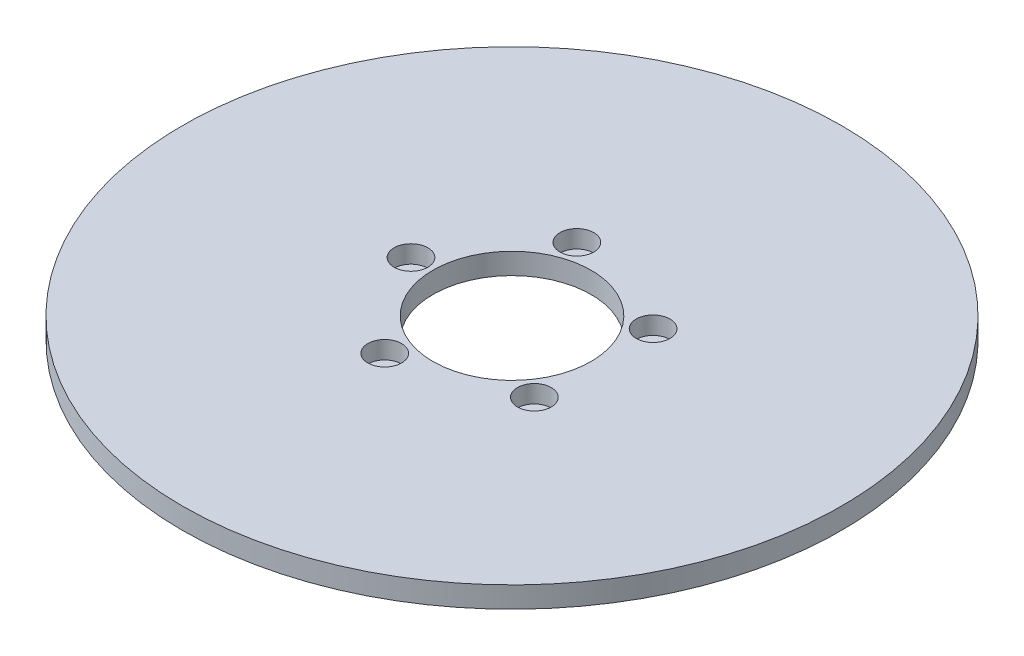
ISO-10303-21;
HEADER;
FILE_DESCRIPTION(('STEP AP214'),'2;1');
FILE_NAME('part.step','',(''),(''),'','','');
FILE_SCHEMA(('AUTOMOTIVE_DESIGN { 1 0 10303 214 1 1 1 1 }'));
ENDSEC;
DATA;
#1=APPLICATION_CONTEXT('core data for automotive mechanical design processes');
#2=APPLICATION_PROTOCOL_DEFINITION('international standard','automotive_design',2000,#1);
#3=PRODUCT_CONTEXT('',#1,'mechanical');
#4=PRODUCT('Part','Part','',(#3));
#5=PRODUCT_RELATED_PRODUCT_CATEGORY('part','',(#4));
#6=PRODUCT_DEFINITION_FORMATION('','',#4);
#7=PRODUCT_DEFINITION_CONTEXT('part definition',#1,'design');
#8=PRODUCT_DEFINITION('design','',#6,#7);
#9=PRODUCT_DEFINITION_SHAPE('','',#8);
#10=(LENGTH_UNIT() NAMED_UNIT(*) SI_UNIT(.MILLI.,.METRE.));
#11=(NAMED_UNIT(*) PLANE_ANGLE_UNIT() SI_UNIT($,.RADIAN.));
#12=(NAMED_UNIT(*) SI_UNIT($,.STERADIAN.) SOLID_ANGLE_UNIT());
#13=UNCERTAINTY_MEASURE_WITH_UNIT(LENGTH_MEASURE(1.E-05),#10,'distance_accuracy_value','');
#14=(GEOMETRIC_REPRESENTATION_CONTEXT(3) GLOBAL_UNCERTAINTY_ASSIGNED_CONTEXT((#13)) GLOBAL_UNIT_ASSIGNED_CONTEXT((#10,
#11,#12)) REPRESENTATION_CONTEXT('',''));
#15=CARTESIAN_POINT('',(0.,0.,0.));
#16=DIRECTION('',(0.,0.,1.));
#17=DIRECTION('',(1.,0.,0.));
#18=AXIS2_PLACEMENT_3D('',#15,#16,#17);
#19=CARTESIAN_POINT('',(0.,4.,0.));
#20=DIRECTION('',(0.,-1.,0.));
#21=DIRECTION('',(0.,0.,-1.));
#22=AXIS2_PLACEMENT_3D('',#19,#20,#21);
#23=CYLINDRICAL_SURFACE('',#22,62.5);
#24=CARTESIAN_POINT('',(0.,4.,0.));
#25=DIRECTION('',(0.,1.,0.));
#26=DIRECTION('',(0.,0.,1.));
#27=AXIS2_PLACEMENT_3D('',#24,#25,#26);
#28=CIRCLE('',#27,62.5);
#29=CARTESIAN_POINT('',(0.,4.,62.5));
#30=VERTEX_POINT('',#29);
#31=EDGE_CURVE('E10',#30,#30,#28,.T.);
#32=ORIENTED_EDGE('',*,*,#31,.F.);
#33=EDGE_LOOP('',(#32));
#34=FACE_BOUND('',#33,.T.);
#35=CARTESIAN_POINT('',(0.,0.,0.));
#36=DIRECTION('',(0.,1.,0.));
#37=DIRECTION('',(0.,0.,1.));
#38=AXIS2_PLACEMENT_3D('',#35,#36,#37);
#39=CIRCLE('',#38,62.5);
#40=CARTESIAN_POINT('',(0.,0.,62.5));
#41=VERTEX_POINT('',#40);
#42=EDGE_CURVE('E37',#41,#41,#39,.T.);
#43=ORIENTED_EDGE('',*,*,#42,.T.);
#44=EDGE_LOOP('',(#43));
#45=FACE_BOUND('',#44,.T.);
#46=ADVANCED_FACE('F40',(#34,#45),#23,.T.);
#47=CARTESIAN_POINT('',(0.,4.,0.));
#48=DIRECTION('',(0.,1.,0.));
#49=DIRECTION('',(0.,0.,1.));
#50=AXIS2_PLACEMENT_3D('',#47,#48,#49);
#51=PLANE('',#50);
#52=CARTESIAN_POINT('',(-5.91968348037825,4.,18.2189123928486));
#53=DIRECTION('',(0.,1.,0.));
#54=DIRECTION('',(0.951056516295155,0.,0.309016994374945));
#55=AXIS2_PLACEMENT_3D('',#52,#53,#54);
#56=CIRCLE('',#55,3.20142961197286);
#57=CARTESIAN_POINT('',(-2.87494298645119,4.,19.2082085492434));
#58=VERTEX_POINT('',#57);
#59=EDGE_CURVE('E78',#58,#58,#56,.T.);
#60=ORIENTED_EDGE('',*,*,#59,.F.);
#61=EDGE_LOOP('',(#60));
#62=FACE_BOUND('',#61,.T.);
#63=CARTESIAN_POINT('',(15.4979325542717,4.,11.259907096837));
#64=DIRECTION('',(0.,1.,0.));
#65=DIRECTION('',(0.587785252292469,0.,-0.809016994374951));
#66=AXIS2_PLACEMENT_3D('',#63,#64,#65);
#67=CIRCLE('',#66,3.20142961197286);
#68=CARTESIAN_POINT('',(17.3796856664418,4.,8.66989613445578));
#69=VERTEX_POINT('',#68);
#70=EDGE_CURVE('E71',#69,#69,#67,.T.);
#71=ORIENTED_EDGE('',*,*,#70,.F.);
#72=EDGE_LOOP('',(#71));
#73=FACE_BOUND('',#72,.T.);
#74=CARTESIAN_POINT('',(15.4979325542716,4.,-11.2599070968373));
#75=DIRECTION('',(0.,1.,0.));
#76=DIRECTION('',(-0.58778525229248,0.,-0.809016994374942));
#77=AXIS2_PLACEMENT_3D('',#74,#75,#76);
#78=CIRCLE('',#77,3.20142961197286);
#79=CARTESIAN_POINT('',(13.6161794421015,4.,-13.8499180592185));
#80=VERTEX_POINT('',#79);
#81=EDGE_CURVE('E70',#80,#80,#78,.T.);
#82=ORIENTED_EDGE('',*,*,#81,.F.);
#83=EDGE_LOOP('',(#82));
#84=FACE_BOUND('',#83,.T.);
#85=CARTESIAN_POINT('',(-5.91968348037851,4.,-18.2189123928485));
#86=DIRECTION('',(0.,1.,0.));
#87=DIRECTION('',(-0.95105651629515,0.,0.309016994374958));
#88=AXIS2_PLACEMENT_3D('',#85,#86,#87);
#89=CIRCLE('',#88,3.20142961197286);
#90=CARTESIAN_POINT('',(-8.96442397430555,4.,-17.2296162364537));
#91=VERTEX_POINT('',#90);
#92=EDGE_CURVE('E61',#91,#91,#89,.T.);
#93=ORIENTED_EDGE('',*,*,#92,.F.);
#94=EDGE_LOOP('',(#93));
#95=FACE_BOUND('',#94,.T.);
#96=CARTESIAN_POINT('',(-19.1564981477867,4.,0.));
#97=DIRECTION('',(0.,1.,0.));
#98=DIRECTION('',(0.,0.,1.));
#99=AXIS2_PLACEMENT_3D('',#96,#97,#98);
#100=CIRCLE('',#99,3.20142961197286);
#101=CARTESIAN_POINT('',(-19.1564981477867,4.,3.20142961197286));
#102=VERTEX_POINT('',#101);
#103=EDGE_CURVE('E54',#102,#102,#100,.T.);
#104=ORIENTED_EDGE('',*,*,#103,.F.);
#105=EDGE_LOOP('',(#104));
#106=FACE_BOUND('',#105,.T.);
#107=CARTESIAN_POINT('',(0.,4.,0.));
#108=DIRECTION('',(0.,1.,0.));
#109=DIRECTION('',(0.,0.,1.));
#110=AXIS2_PLACEMENT_3D('',#107,#108,#109);
#111=CIRCLE('',#110,15.);
#112=CARTESIAN_POINT('',(0.,4.,15.));
#113=VERTEX_POINT('',#112);
#114=EDGE_CURVE('E50',#113,#113,#111,.T.);
#115=ORIENTED_EDGE('',*,*,#114,.F.);
#116=EDGE_LOOP('',(#115));
#117=FACE_BOUND('',#116,.T.);
#118=ORIENTED_EDGE('',*,*,#31,.T.);
#119=EDGE_LOOP('',(#118));
#120=FACE_BOUND('',#119,.T.);
#121=ADVANCED_FACE('F94',(#62,#73,#84,#95,#106,#117,#120),#51,.T.);
#122=CARTESIAN_POINT('',(0.,0.,0.));
#123=DIRECTION('',(0.,1.,0.));
#124=DIRECTION('',(0.,0.,1.));
#125=AXIS2_PLACEMENT_3D('',#122,#123,#124);
#126=PLANE('',#125);
#127=CARTESIAN_POINT('',(0.,0.,0.));
#128=DIRECTION('',(0.,1.,0.));
#129=DIRECTION('',(0.,0.,1.));
#130=AXIS2_PLACEMENT_3D('',#127,#128,#129);
#131=CIRCLE('',#130,15.);
#132=CARTESIAN_POINT('',(0.,0.,15.));
#133=VERTEX_POINT('',#132);
#134=EDGE_CURVE('E47',#133,#133,#131,.T.);
#135=ORIENTED_EDGE('',*,*,#134,.T.);
#136=EDGE_LOOP('',(#135));
#137=FACE_BOUND('',#136,.T.);
#138=ORIENTED_EDGE('',*,*,#42,.F.);
#139=EDGE_LOOP('',(#138));
#140=FACE_BOUND('',#139,.T.);
#141=ADVANCED_FACE('F100',(#137,#140),#126,.F.);
#142=CARTESIAN_POINT('',(0.,4.,0.));
#143=DIRECTION('',(0.,-1.,0.));
#144=DIRECTION('',(0.,0.,-1.));
#145=AXIS2_PLACEMENT_3D('',#142,#143,#144);
#146=CYLINDRICAL_SURFACE('',#145,15.);
#147=ORIENTED_EDGE('',*,*,#114,.T.);
#148=EDGE_LOOP('',(#147));
#149=FACE_BOUND('',#148,.T.);
#150=ORIENTED_EDGE('',*,*,#134,.F.);
#151=EDGE_LOOP('',(#150));
#152=FACE_BOUND('',#151,.T.);
#153=ADVANCED_FACE('F108',(#149,#152),#146,.F.);
#154=CARTESIAN_POINT('',(-19.1564981477867,0.639174739748794,0.));
#155=DIRECTION('',(0.,1.,0.));
#156=DIRECTION('',(0.,0.,1.));
#157=AXIS2_PLACEMENT_3D('',#154,#155,#156);
#158=CYLINDRICAL_SURFACE('',#157,3.20142961197286);
#159=CARTESIAN_POINT('',(-19.1564981477867,0.639174739748794,0.));
#160=DIRECTION('',(0.,1.,0.));
#161=DIRECTION('',(0.,0.,1.));
#162=AXIS2_PLACEMENT_3D('',#159,#160,#161);
#163=CIRCLE('',#162,3.20142961197286);
#164=CARTESIAN_POINT('',(-19.1564981477867,0.639174739748794,3.20142961197286));
#165=VERTEX_POINT('',#164);
#166=EDGE_CURVE('E55',#165,#165,#163,.T.);
#167=ORIENTED_EDGE('',*,*,#166,.F.);
#168=EDGE_LOOP('',(#167));
#169=FACE_BOUND('',#168,.T.);
#170=ORIENTED_EDGE('',*,*,#103,.T.);
#171=EDGE_LOOP('',(#170));
#172=FACE_BOUND('',#171,.T.);
#173=ADVANCED_FACE('F115',(#169,#172),#158,.F.);
#174=CARTESIAN_POINT('',(-19.1564981477867,0.639174739748794,0.));
#175=DIRECTION('',(0.,1.,0.));
#176=DIRECTION('',(0.,0.,1.));
#177=AXIS2_PLACEMENT_3D('',#174,#175,#176);
#178=PLANE('',#177);
#179=ORIENTED_EDGE('',*,*,#166,.T.);
#180=EDGE_LOOP('',(#179));
#181=FACE_BOUND('',#180,.T.);
#182=ADVANCED_FACE('F142',(#181),#178,.T.);
#183=CARTESIAN_POINT('',(-5.91968348037851,0.639174739748794,-18.2189123928485));
#184=DIRECTION('',(0.,1.,0.));
#185=DIRECTION('',(0.,0.,1.));
#186=AXIS2_PLACEMENT_3D('',#183,#184,#185);
#187=CYLINDRICAL_SURFACE('',#186,3.20142961197286);
#188=CARTESIAN_POINT('',(-5.91968348037851,0.639174739748794,-18.2189123928485));
#189=DIRECTION('',(0.,1.,0.));
#190=DIRECTION('',(-0.95105651629515,0.,0.309016994374958));
#191=AXIS2_PLACEMENT_3D('',#188,#189,#190);
#192=CIRCLE('',#191,3.20142961197286);
#193=CARTESIAN_POINT('',(-8.96442397430555,0.639174739748794,-17.2296162364537));
#194=VERTEX_POINT('',#193);
#195=EDGE_CURVE('E63',#194,#194,#192,.T.);
#196=ORIENTED_EDGE('',*,*,#195,.F.);
#197=EDGE_LOOP('',(#196));
#198=FACE_BOUND('',#197,.T.);
#199=ORIENTED_EDGE('',*,*,#92,.T.);
#200=EDGE_LOOP('',(#199));
#201=FACE_BOUND('',#200,.T.);
#202=ADVANCED_FACE('F147',(#198,#201),#187,.F.);
#203=CARTESIAN_POINT('',(-5.91968348037851,0.639174739748794,-18.2189123928485));
#204=DIRECTION('',(0.,1.,0.));
#205=DIRECTION('',(-0.95105651629515,0.,0.309016994374958));
#206=AXIS2_PLACEMENT_3D('',#203,#204,#205);
#207=PLANE('',#206);
#208=ORIENTED_EDGE('',*,*,#195,.T.);
#209=EDGE_LOOP('',(#208));
#210=FACE_BOUND('',#209,.T.);
#211=ADVANCED_FACE('F163',(#210),#207,.T.);
#212=CARTESIAN_POINT('',(15.4979325542716,0.639174739748794,-11.2599070968373));
#213=DIRECTION('',(0.,1.,0.));
#214=DIRECTION('',(0.,0.,1.));
#215=AXIS2_PLACEMENT_3D('',#212,#213,#214);
#216=CYLINDRICAL_SURFACE('',#215,3.20142961197286);
#217=CARTESIAN_POINT('',(15.4979325542716,0.639174739748794,-11.2599070968373));
#218=DIRECTION('',(0.,1.,0.));
#219=DIRECTION('',(-0.58778525229248,0.,-0.809016994374942));
#220=AXIS2_PLACEMENT_3D('',#217,#218,#219);
#221=CIRCLE('',#220,3.20142961197286);
#222=CARTESIAN_POINT('',(13.6161794421015,0.639174739748794,-13.8499180592185));
#223=VERTEX_POINT('',#222);
#224=EDGE_CURVE('E69',#223,#223,#221,.T.);
#225=ORIENTED_EDGE('',*,*,#224,.F.);
#226=EDGE_LOOP('',(#225));
#227=FACE_BOUND('',#226,.T.);
#228=ORIENTED_EDGE('',*,*,#81,.T.);
#229=EDGE_LOOP('',(#228));
#230=FACE_BOUND('',#229,.T.);
#231=ADVANCED_FACE('F172',(#227,#230),#216,.F.);
#232=CARTESIAN_POINT('',(15.4979325542716,0.639174739748794,-11.2599070968373));
#233=DIRECTION('',(0.,1.,0.));
#234=DIRECTION('',(-0.58778525229248,0.,-0.809016994374942));
#235=AXIS2_PLACEMENT_3D('',#232,#233,#234);
#236=PLANE('',#235);
#237=ORIENTED_EDGE('',*,*,#224,.T.);
#238=EDGE_LOOP('',(#237));
#239=FACE_BOUND('',#238,.T.);
#240=ADVANCED_FACE('F185',(#239),#236,.T.);
#241=CARTESIAN_POINT('',(15.4979325542717,0.639174739748794,11.259907096837));
#242=DIRECTION('',(0.,1.,0.));
#243=DIRECTION('',(0.,0.,1.));
#244=AXIS2_PLACEMENT_3D('',#241,#242,#243);
#245=CYLINDRICAL_SURFACE('',#244,3.20142961197286);
#246=CARTESIAN_POINT('',(15.4979325542717,0.639174739748794,11.259907096837));
#247=DIRECTION('',(0.,1.,0.));
#248=DIRECTION('',(0.587785252292469,0.,-0.809016994374951));
#249=AXIS2_PLACEMENT_3D('',#246,#247,#248);
#250=CIRCLE('',#249,3.20142961197286);
#251=CARTESIAN_POINT('',(17.3796856664418,0.639174739748794,8.66989613445578));
#252=VERTEX_POINT('',#251);
#253=EDGE_CURVE('E76',#252,#252,#250,.T.);
#254=ORIENTED_EDGE('',*,*,#253,.F.);
#255=EDGE_LOOP('',(#254));
#256=FACE_BOUND('',#255,.T.);
#257=ORIENTED_EDGE('',*,*,#70,.T.);
#258=EDGE_LOOP('',(#257));
#259=FACE_BOUND('',#258,.T.);
#260=ADVANCED_FACE('F191',(#256,#259),#245,.F.);
#261=CARTESIAN_POINT('',(15.4979325542717,0.639174739748794,11.259907096837));
#262=DIRECTION('',(0.,1.,0.));
#263=DIRECTION('',(0.587785252292469,0.,-0.809016994374951));
#264=AXIS2_PLACEMENT_3D('',#261,#262,#263);
#265=PLANE('',#264);
#266=ORIENTED_EDGE('',*,*,#253,.T.);
#267=EDGE_LOOP('',(#266));
#268=FACE_BOUND('',#267,.T.);
#269=ADVANCED_FACE('F89',(#268),#265,.T.);
#270=CARTESIAN_POINT('',(-5.91968348037825,0.639174739748794,18.2189123928486));
#271=DIRECTION('',(0.,1.,0.));
#272=DIRECTION('',(0.,0.,1.));
#273=AXIS2_PLACEMENT_3D('',#270,#271,#272);
#274=CYLINDRICAL_SURFACE('',#273,3.20142961197286);
#275=CARTESIAN_POINT('',(-5.91968348037825,0.639174739748794,18.2189123928486));
#276=DIRECTION('',(0.,1.,0.));
#277=DIRECTION('',(0.951056516295155,0.,0.309016994374945));
#278=AXIS2_PLACEMENT_3D('',#275,#276,#277);
#279=CIRCLE('',#278,3.20142961197286);
#280=CARTESIAN_POINT('',(-2.87494298645119,0.639174739748794,19.2082085492434));
#281=VERTEX_POINT('',#280);
#282=EDGE_CURVE('E59',#281,#281,#279,.T.);
#283=ORIENTED_EDGE('',*,*,#282,.F.);
#284=EDGE_LOOP('',(#283));
#285=FACE_BOUND('',#284,.T.);
#286=ORIENTED_EDGE('',*,*,#59,.T.);
#287=EDGE_LOOP('',(#286));
#288=FACE_BOUND('',#287,.T.);
#289=ADVANCED_FACE('F87',(#285,#288),#274,.F.);
#290=CARTESIAN_POINT('',(-5.91968348037825,0.639174739748794,18.2189123928486));
#291=DIRECTION('',(0.,1.,0.));
#292=DIRECTION('',(0.951056516295155,0.,0.309016994374945));
#293=AXIS2_PLACEMENT_3D('',#290,#291,#292);
#294=PLANE('',#293);
#295=ORIENTED_EDGE('',*,*,#282,.T.);
#296=EDGE_LOOP('',(#295));
#297=FACE_BOUND('',#296,.T.);
#298=ADVANCED_FACE('F84',(#297),#294,.T.);
#299=CLOSED_SHELL('',(#46,#121,#141,#153,#173,#182,#202,#211,#231,#240,#260,#269,#289,#298));
#300=MANIFOLD_SOLID_BREP('B2',#299);
#301=ADVANCED_BREP_SHAPE_REPRESENTATION('',(#18,#300),#14);
#302=SHAPE_DEFINITION_REPRESENTATION(#9,#301);
ENDSEC;
END-ISO-10303-21;
